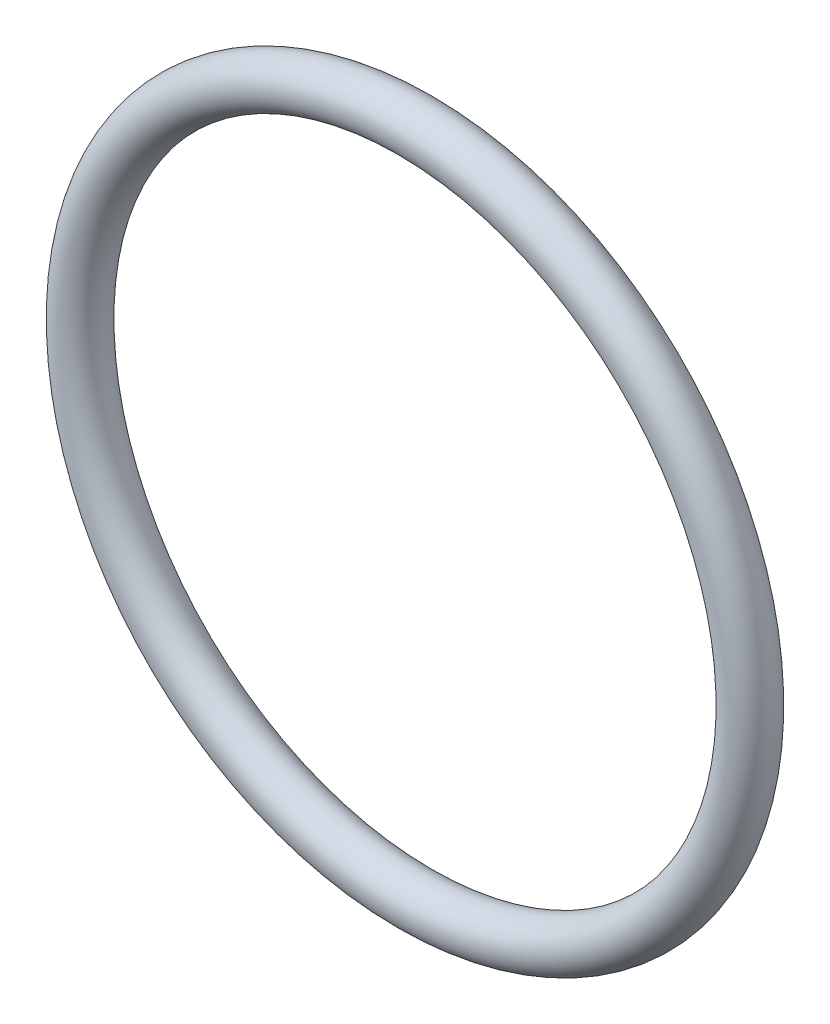
ISO-10303-21;
HEADER;
FILE_DESCRIPTION(('STEP AP214'),'2;1');
FILE_NAME('part.step','',(''),(''),'','','');
FILE_SCHEMA(('AUTOMOTIVE_DESIGN { 1 0 10303 214 1 1 1 1 }'));
ENDSEC;
DATA;
#1=APPLICATION_CONTEXT('core data for automotive mechanical design processes');
#2=APPLICATION_PROTOCOL_DEFINITION('international standard','automotive_design',2000,#1);
#3=PRODUCT_CONTEXT('',#1,'mechanical');
#4=PRODUCT('Part','Part','',(#3));
#5=PRODUCT_RELATED_PRODUCT_CATEGORY('part','',(#4));
#6=PRODUCT_DEFINITION_FORMATION('','',#4);
#7=PRODUCT_DEFINITION_CONTEXT('part definition',#1,'design');
#8=PRODUCT_DEFINITION('design','',#6,#7);
#9=PRODUCT_DEFINITION_SHAPE('','',#8);
#10=(LENGTH_UNIT() NAMED_UNIT(*) SI_UNIT(.MILLI.,.METRE.));
#11=(NAMED_UNIT(*) PLANE_ANGLE_UNIT() SI_UNIT($,.RADIAN.));
#12=(NAMED_UNIT(*) SI_UNIT($,.STERADIAN.) SOLID_ANGLE_UNIT());
#13=UNCERTAINTY_MEASURE_WITH_UNIT(LENGTH_MEASURE(1.E-05),#10,'distance_accuracy_value','');
#14=(GEOMETRIC_REPRESENTATION_CONTEXT(3) GLOBAL_UNCERTAINTY_ASSIGNED_CONTEXT((#13)) GLOBAL_UNIT_ASSIGNED_CONTEXT((#10,
#11,#12)) REPRESENTATION_CONTEXT('',''));
#15=CARTESIAN_POINT('',(0.,0.,0.));
#16=DIRECTION('',(0.,0.,1.));
#17=DIRECTION('',(1.,0.,0.));
#18=AXIS2_PLACEMENT_3D('',#15,#16,#17);
#19=CARTESIAN_POINT('',(0.,0.,0.));
#20=DIRECTION('',(0.,0.,1.));
#21=DIRECTION('',(1.,0.,0.));
#22=AXIS2_PLACEMENT_3D('',#19,#20,#21);
#23=TOROIDAL_SURFACE('',#22,28.,2.);
#24=CARTESIAN_POINT('',(0.,28.,0.));
#25=DIRECTION('',(1.,0.,0.));
#26=DIRECTION('',(0.,0.,-1.));
#27=AXIS2_PLACEMENT_3D('',#24,#25,#26);
#28=CIRCLE('',#27,2.);
#29=CARTESIAN_POINT('',(0.,30.,0.));
#30=VERTEX_POINT('',#29);
#31=EDGE_CURVE('E10',#30,#30,#28,.T.);
#32=CARTESIAN_POINT('',(0.,0.,0.));
#33=DIRECTION('',(0.,0.,1.));
#34=DIRECTION('',(1.,0.,0.));
#35=AXIS2_PLACEMENT_3D('',#32,#33,#34);
#36=CIRCLE('',#35,30.);
#37=EDGE_CURVE('',#30,#30,#36,.T.);
#38=ORIENTED_EDGE('',*,*,#31,.F.);
#39=ORIENTED_EDGE('',*,*,#31,.T.);
#40=ORIENTED_EDGE('',*,*,#37,.T.);
#41=ORIENTED_EDGE('',*,*,#37,.F.);
#42=EDGE_LOOP('',(#38,#40,#39,#41));
#43=FACE_BOUND('',#42,.T.);
#44=ADVANCED_FACE('F37',(#43),#23,.T.);
#45=CLOSED_SHELL('',(#44));
#46=MANIFOLD_SOLID_BREP('B2',#45);
#47=ADVANCED_BREP_SHAPE_REPRESENTATION('',(#18,#46),#14);
#48=SHAPE_DEFINITION_REPRESENTATION(#9,#47);
ENDSEC;
END-ISO-10303-21;
